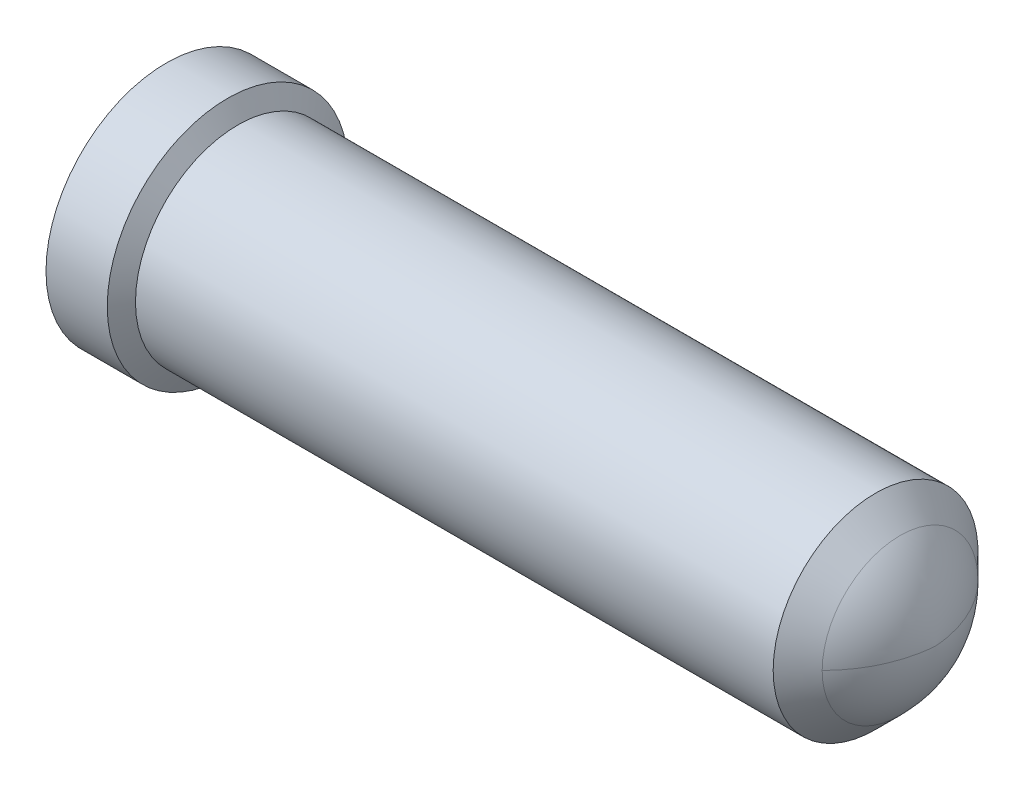
ISO-10303-21;
HEADER;
FILE_DESCRIPTION(('STEP AP214'),'2;1');
FILE_NAME('part.step','',(''),(''),'','','');
FILE_SCHEMA(('AUTOMOTIVE_DESIGN { 1 0 10303 214 1 1 1 1 }'));
ENDSEC;
DATA;
#1=APPLICATION_CONTEXT('core data for automotive mechanical design processes');
#2=APPLICATION_PROTOCOL_DEFINITION('international standard','automotive_design',2000,#1);
#3=PRODUCT_CONTEXT('',#1,'mechanical');
#4=PRODUCT('Part','Part','',(#3));
#5=PRODUCT_RELATED_PRODUCT_CATEGORY('part','',(#4));
#6=PRODUCT_DEFINITION_FORMATION('','',#4);
#7=PRODUCT_DEFINITION_CONTEXT('part definition',#1,'design');
#8=PRODUCT_DEFINITION('design','',#6,#7);
#9=PRODUCT_DEFINITION_SHAPE('','',#8);
#10=(LENGTH_UNIT() NAMED_UNIT(*) SI_UNIT(.MILLI.,.METRE.));
#11=(NAMED_UNIT(*) PLANE_ANGLE_UNIT() SI_UNIT($,.RADIAN.));
#12=(NAMED_UNIT(*) SI_UNIT($,.STERADIAN.) SOLID_ANGLE_UNIT());
#13=UNCERTAINTY_MEASURE_WITH_UNIT(LENGTH_MEASURE(1.E-05),#10,'distance_accuracy_value','');
#14=(GEOMETRIC_REPRESENTATION_CONTEXT(3) GLOBAL_UNCERTAINTY_ASSIGNED_CONTEXT((#13)) GLOBAL_UNIT_ASSIGNED_CONTEXT((#10,
#11,#12)) REPRESENTATION_CONTEXT('',''));
#15=CARTESIAN_POINT('',(0.,0.,0.));
#16=DIRECTION('',(0.,0.,1.));
#17=DIRECTION('',(1.,0.,0.));
#18=AXIS2_PLACEMENT_3D('',#15,#16,#17);
#19=CARTESIAN_POINT('',(3.8034201808,0.,-0.40386));
#20=CARTESIAN_POINT('',(3.8034201808,-0.80772,-0.40386));
#21=CARTESIAN_POINT('',(3.8034201808,-0.80772,0.40386));
#22=CARTESIAN_POINT('',(3.8034201808,0.,0.40386));
#23=CARTESIAN_POINT('',(3.9126566654,0.,-0.2946235154));
#24=CARTESIAN_POINT('',(3.9126566654,-0.5892470054,-0.2946235154));
#25=CARTESIAN_POINT('',(3.9126566654,-0.5892470054,0.2946235154));
#26=CARTESIAN_POINT('',(3.9126566654,0.,0.2946235154));
#27=CARTESIAN_POINT('',(3.9768151604,0.,-0.1540926814));
#28=CARTESIAN_POINT('',(3.9768151604,-0.3081853628,-0.1540926814));
#29=CARTESIAN_POINT('',(3.9768151604,-0.3081853628,0.1540926814));
#30=CARTESIAN_POINT('',(3.9768151604,0.,0.1540926814));
#31=CARTESIAN_POINT('',(3.9878,0.,0.));
#32=CARTESIAN_POINT('',(3.9878,0.,0.));
#33=CARTESIAN_POINT('',(3.9878,0.,0.));
#34=CARTESIAN_POINT('',(3.9878,0.,0.));
#35=(BOUNDED_SURFACE() B_SPLINE_SURFACE(3,3,((#19,#20,#21,#22),(#23,#24,#25,#26),(#27,#28,#29,
#30),(#31,#32,#33,#34)),.UNSPECIFIED.,.F.,.F.,.F.) B_SPLINE_SURFACE_WITH_KNOTS((4,4),(4,4),(0.,
1.),(0.,1.),.UNSPECIFIED.) GEOMETRIC_REPRESENTATION_ITEM() RATIONAL_B_SPLINE_SURFACE(((1.,
0.333333333333333,0.333333333333333,1.),(0.957939338108256,0.319313112702752,0.319313112702752,
0.957939338108256),(0.957939338108256,0.319313112702752,0.319313112702752,0.957939338108256),
(1.,0.333333333333333,0.333333333333333,1.))) REPRESENTATION_ITEM('') SURFACE());
#36=CARTESIAN_POINT('',(3.8034201808,0.,0.40386));
#37=CARTESIAN_POINT('',(3.9126566654,0.,0.2946235154));
#38=CARTESIAN_POINT('',(3.9768151604,0.,0.1540926814));
#39=CARTESIAN_POINT('',(3.9878,0.,0.));
#40=(BOUNDED_CURVE() B_SPLINE_CURVE(3,(#36,#37,#38,#39),.UNSPECIFIED.,.F.,
.F.) B_SPLINE_CURVE_WITH_KNOTS((4,4),(0.,1.),
.UNSPECIFIED.) CURVE() GEOMETRIC_REPRESENTATION_ITEM() RATIONAL_B_SPLINE_CURVE((1.,
0.957939338108256,0.957939338108256,1.)) REPRESENTATION_ITEM(''));
#41=CARTESIAN_POINT('',(3.80342018080003,-1.81320273886141E-11,0.40385999999999));
#42=VERTEX_POINT('',#41);
#43=CARTESIAN_POINT('',(3.9878,0.,0.));
#44=VERTEX_POINT('',#43);
#45=EDGE_CURVE('E45',#42,#44,#40,.T.);
#46=CARTESIAN_POINT('',(3.80342018080004,0.,0.));
#47=DIRECTION('',(-1.,0.,0.));
#48=DIRECTION('',(-1.04162443154652E-13,0.,1.));
#49=AXIS2_PLACEMENT_3D('',#46,#47,#48);
#50=CIRCLE('',#49,0.40386);
#51=CARTESIAN_POINT('',(3.80342018080003,-1.24249605960298E-10,-0.40385999999999));
#52=VERTEX_POINT('',#51);
#53=EDGE_CURVE('E51',#42,#52,#50,.F.);
#54=CARTESIAN_POINT('',(3.8034201808,0.,-0.40386));
#55=CARTESIAN_POINT('',(3.9126566654,0.,-0.2946235154));
#56=CARTESIAN_POINT('',(3.9768151604,0.,-0.1540926814));
#57=CARTESIAN_POINT('',(3.9878,0.,0.));
#58=(BOUNDED_CURVE() B_SPLINE_CURVE(3,(#54,#55,#56,#57),.UNSPECIFIED.,.F.,
.F.) B_SPLINE_CURVE_WITH_KNOTS((4,4),(0.,1.),
.UNSPECIFIED.) CURVE() GEOMETRIC_REPRESENTATION_ITEM() RATIONAL_B_SPLINE_CURVE((1.,
0.957939338108256,0.957939338108256,1.)) REPRESENTATION_ITEM(''));
#59=EDGE_CURVE('E57',#44,#52,#58,.F.);
#60=ORIENTED_EDGE('',*,*,#45,.F.);
#61=ORIENTED_EDGE('',*,*,#53,.T.);
#62=ORIENTED_EDGE('',*,*,#59,.F.);
#63=EDGE_LOOP('',(#60,#61,#62));
#64=FACE_BOUND('',#63,.T.);
#65=ADVANCED_FACE('F17',(#64),#35,.T.);
#66=CARTESIAN_POINT('',(3.8034201808,0.,0.40386));
#67=CARTESIAN_POINT('',(3.8034201808,0.80772,0.40386));
#68=CARTESIAN_POINT('',(3.8034201808,0.80772,-0.40386));
#69=CARTESIAN_POINT('',(3.8034201808,0.,-0.40386));
#70=CARTESIAN_POINT('',(3.9126566654,0.,0.2946235154));
#71=CARTESIAN_POINT('',(3.9126566654,0.5892470054,0.2946235154));
#72=CARTESIAN_POINT('',(3.9126566654,0.5892470054,-0.2946235154));
#73=CARTESIAN_POINT('',(3.9126566654,0.,-0.2946235154));
#74=CARTESIAN_POINT('',(3.9768151604,0.,0.1540926814));
#75=CARTESIAN_POINT('',(3.9768151604,0.3081853628,0.1540926814));
#76=CARTESIAN_POINT('',(3.9768151604,0.3081853628,-0.1540926814));
#77=CARTESIAN_POINT('',(3.9768151604,0.,-0.1540926814));
#78=CARTESIAN_POINT('',(3.9878,0.,0.));
#79=CARTESIAN_POINT('',(3.9878,0.,0.));
#80=CARTESIAN_POINT('',(3.9878,0.,0.));
#81=CARTESIAN_POINT('',(3.9878,0.,0.));
#82=(BOUNDED_SURFACE() B_SPLINE_SURFACE(3,3,((#66,#67,#68,#69),(#70,#71,#72,#73),(#74,#75,#76,
#77),(#78,#79,#80,#81)),.UNSPECIFIED.,.F.,.F.,.F.) B_SPLINE_SURFACE_WITH_KNOTS((4,4),(4,4),(0.,
1.),(0.,1.),.UNSPECIFIED.) GEOMETRIC_REPRESENTATION_ITEM() RATIONAL_B_SPLINE_SURFACE(((1.,
0.333333333333333,0.333333333333333,1.),(0.957939338108256,0.319313112702752,0.319313112702752,
0.957939338108256),(0.957939338108256,0.319313112702752,0.319313112702752,0.957939338108256),
(1.,0.333333333333333,0.333333333333333,1.))) REPRESENTATION_ITEM('') SURFACE());
#83=CARTESIAN_POINT('',(3.80342018080004,0.,0.));
#84=DIRECTION('',(-1.,0.,0.));
#85=DIRECTION('',(-1.04162443154652E-13,0.,1.));
#86=AXIS2_PLACEMENT_3D('',#83,#84,#85);
#87=CIRCLE('',#86,0.40386);
#88=EDGE_CURVE('E53',#52,#42,#87,.F.);
#89=ORIENTED_EDGE('',*,*,#59,.T.);
#90=ORIENTED_EDGE('',*,*,#88,.T.);
#91=ORIENTED_EDGE('',*,*,#45,.T.);
#92=EDGE_LOOP('',(#89,#90,#91));
#93=FACE_BOUND('',#92,.T.);
#94=ADVANCED_FACE('F60',(#93),#82,.T.);
#95=CARTESIAN_POINT('',(3.8034201808,0.,0.));
#96=DIRECTION('',(-1.,0.,0.));
#97=DIRECTION('',(0.,-1.,0.));
#98=AXIS2_PLACEMENT_3D('',#95,#96,#97);
#99=CONICAL_SURFACE('',#98,0.40386,0.785398163397449);
#100=CARTESIAN_POINT('',(3.6764201808,0.,0.));
#101=DIRECTION('',(-1.,0.,0.));
#102=DIRECTION('',(0.,0.,1.));
#103=AXIS2_PLACEMENT_3D('',#100,#101,#102);
#104=CIRCLE('',#103,0.53086);
#105=CARTESIAN_POINT('',(3.6764201808,0.,0.53086));
#106=VERTEX_POINT('',#105);
#107=EDGE_CURVE('E62',#106,#106,#104,.F.);
#108=ORIENTED_EDGE('',*,*,#107,.T.);
#109=EDGE_LOOP('',(#108));
#110=FACE_BOUND('',#109,.T.);
#111=ORIENTED_EDGE('',*,*,#88,.F.);
#112=ORIENTED_EDGE('',*,*,#53,.F.);
#113=EDGE_LOOP('',(#111,#112));
#114=FACE_BOUND('',#113,.T.);
#115=ADVANCED_FACE('F52',(#110,#114),#99,.T.);
#116=CARTESIAN_POINT('',(3.6764201808,0.,0.));
#117=DIRECTION('',(-1.,0.,0.));
#118=DIRECTION('',(0.,0.,1.));
#119=AXIS2_PLACEMENT_3D('',#116,#117,#118);
#120=CYLINDRICAL_SURFACE('',#119,0.53086);
#121=CARTESIAN_POINT('',(0.371026131199992,0.,0.));
#122=DIRECTION('',(-1.,0.,0.));
#123=DIRECTION('',(0.,0.,1.));
#124=AXIS2_PLACEMENT_3D('',#121,#122,#123);
#125=CIRCLE('',#124,0.53086);
#126=CARTESIAN_POINT('',(0.3710261312,0.,0.53086));
#127=VERTEX_POINT('',#126);
#128=EDGE_CURVE('E67',#127,#127,#125,.F.);
#129=ORIENTED_EDGE('',*,*,#128,.T.);
#130=EDGE_LOOP('',(#129));
#131=FACE_BOUND('',#130,.T.);
#132=ORIENTED_EDGE('',*,*,#107,.F.);
#133=EDGE_LOOP('',(#132));
#134=FACE_BOUND('',#133,.T.);
#135=ADVANCED_FACE('F138',(#131,#134),#120,.T.);
#136=CARTESIAN_POINT('',(0.3710261312,0.,0.));
#137=DIRECTION('',(-1.,0.,0.));
#138=DIRECTION('',(0.,0.,1.));
#139=AXIS2_PLACEMENT_3D('',#136,#137,#138);
#140=CONICAL_SURFACE('',#139,0.53086,1.0471976503491);
#141=CARTESIAN_POINT('',(0.3175,0.,0.));
#142=DIRECTION('',(-1.,0.,0.));
#143=DIRECTION('',(0.,0.,1.));
#144=AXIS2_PLACEMENT_3D('',#141,#142,#143);
#145=CIRCLE('',#144,0.62357);
#146=CARTESIAN_POINT('',(0.3175,0.,0.62357));
#147=VERTEX_POINT('',#146);
#148=EDGE_CURVE('E93',#147,#147,#145,.F.);
#149=ORIENTED_EDGE('',*,*,#148,.T.);
#150=EDGE_LOOP('',(#149));
#151=FACE_BOUND('',#150,.T.);
#152=ORIENTED_EDGE('',*,*,#128,.F.);
#153=EDGE_LOOP('',(#152));
#154=FACE_BOUND('',#153,.T.);
#155=ADVANCED_FACE('F135',(#151,#154),#140,.T.);
#156=CARTESIAN_POINT('',(2.2051134714,0.,0.));
#157=DIRECTION('',(-1.,0.,0.));
#158=DIRECTION('',(0.,0.,1.));
#159=AXIS2_PLACEMENT_3D('',#156,#157,#158);
#160=CONICAL_SURFACE('',#159,0.,1.02974426449315);
#161=CARTESIAN_POINT('',(2.2051134714,0.,0.));
#162=VERTEX_POINT('',#161);
#163=VERTEX_LOOP('',#162);
#164=FACE_BOUND('',#163,.T.);
#165=CARTESIAN_POINT('',(1.9304,0.,0.));
#166=DIRECTION('',(-1.,0.,0.));
#167=DIRECTION('',(0.,0.,1.));
#168=AXIS2_PLACEMENT_3D('',#165,#166,#167);
#169=CIRCLE('',#168,0.4572);
#170=CARTESIAN_POINT('',(1.9304,0.,0.4572));
#171=VERTEX_POINT('',#170);
#172=EDGE_CURVE('E97',#171,#171,#169,.F.);
#173=ORIENTED_EDGE('',*,*,#172,.F.);
#174=EDGE_LOOP('',(#173));
#175=FACE_BOUND('',#174,.T.);
#176=ADVANCED_FACE('F129',(#164,#175),#160,.F.);
#177=CARTESIAN_POINT('',(0.3175,0.,0.));
#178=DIRECTION('',(-1.,0.,0.));
#179=DIRECTION('',(0.,0.,1.));
#180=AXIS2_PLACEMENT_3D('',#177,#178,#179);
#181=CYLINDRICAL_SURFACE('',#180,0.62357);
#182=CARTESIAN_POINT('',(0.,0.,0.));
#183=DIRECTION('',(-1.,0.,0.));
#184=DIRECTION('',(0.,0.,1.));
#185=AXIS2_PLACEMENT_3D('',#182,#183,#184);
#186=CIRCLE('',#185,0.62357);
#187=CARTESIAN_POINT('',(0.,0.,0.62357));
#188=VERTEX_POINT('',#187);
#189=EDGE_CURVE('E21',#188,#188,#186,.F.);
#190=ORIENTED_EDGE('',*,*,#189,.T.);
#191=EDGE_LOOP('',(#190));
#192=FACE_BOUND('',#191,.T.);
#193=ORIENTED_EDGE('',*,*,#148,.F.);
#194=EDGE_LOOP('',(#193));
#195=FACE_BOUND('',#194,.T.);
#196=ADVANCED_FACE('F109',(#192,#195),#181,.T.);
#197=CARTESIAN_POINT('',(1.9304,0.,0.));
#198=DIRECTION('',(-1.,0.,0.));
#199=DIRECTION('',(0.,0.,1.));
#200=AXIS2_PLACEMENT_3D('',#197,#198,#199);
#201=CYLINDRICAL_SURFACE('',#200,0.4572);
#202=CARTESIAN_POINT('',(0.0888999999999474,0.,0.));
#203=DIRECTION('',(-1.,0.,0.));
#204=DIRECTION('',(1.15220194784863E-13,0.,1.));
#205=AXIS2_PLACEMENT_3D('',#202,#203,#204);
#206=CIRCLE('',#205,0.4572);
#207=CARTESIAN_POINT('',(0.0889,0.,0.4572));
#208=VERTEX_POINT('',#207);
#209=EDGE_CURVE('E28',#208,#208,#206,.F.);
#210=ORIENTED_EDGE('',*,*,#209,.F.);
#211=EDGE_LOOP('',(#210));
#212=FACE_BOUND('',#211,.T.);
#213=ORIENTED_EDGE('',*,*,#172,.T.);
#214=EDGE_LOOP('',(#213));
#215=FACE_BOUND('',#214,.T.);
#216=ADVANCED_FACE('F114',(#212,#215),#201,.F.);
#217=CARTESIAN_POINT('',(0.,-0.63105284,0.63105284));
#218=DIRECTION('',(1.,0.,0.));
#219=DIRECTION('',(0.,0.,-1.));
#220=AXIS2_PLACEMENT_3D('',#217,#218,#219);
#221=PLANE('',#220);
#222=CARTESIAN_POINT('',(0.,0.,0.));
#223=DIRECTION('',(-1.,0.,0.));
#224=DIRECTION('',(0.,0.,1.));
#225=AXIS2_PLACEMENT_3D('',#222,#223,#224);
#226=CIRCLE('',#225,0.5461);
#227=CARTESIAN_POINT('',(0.,0.,0.5461));
#228=VERTEX_POINT('',#227);
#229=EDGE_CURVE('E11',#228,#228,#226,.T.);
#230=ORIENTED_EDGE('',*,*,#229,.F.);
#231=EDGE_LOOP('',(#230));
#232=FACE_BOUND('',#231,.T.);
#233=ORIENTED_EDGE('',*,*,#189,.F.);
#234=EDGE_LOOP('',(#233));
#235=FACE_BOUND('',#234,.T.);
#236=ADVANCED_FACE('F19',(#232,#235),#221,.F.);
#237=CARTESIAN_POINT('',(0.0889,0.,0.));
#238=DIRECTION('',(-1.,0.,0.));
#239=DIRECTION('',(0.,0.,1.));
#240=AXIS2_PLACEMENT_3D('',#237,#238,#239);
#241=CONICAL_SURFACE('',#240,0.4572,0.785398163397449);
#242=ORIENTED_EDGE('',*,*,#229,.T.);
#243=EDGE_LOOP('',(#242));
#244=FACE_BOUND('',#243,.T.);
#245=ORIENTED_EDGE('',*,*,#209,.T.);
#246=EDGE_LOOP('',(#245));
#247=FACE_BOUND('',#246,.T.);
#248=ADVANCED_FACE('F113',(#244,#247),#241,.F.);
#249=CLOSED_SHELL('',(#65,#94,#115,#135,#155,#176,#196,#216,#236,#248));
#250=MANIFOLD_SOLID_BREP('B1',#249);
#251=ADVANCED_BREP_SHAPE_REPRESENTATION('',(#18,#250),#14);
#252=SHAPE_DEFINITION_REPRESENTATION(#9,#251);
ENDSEC;
END-ISO-10303-21;
